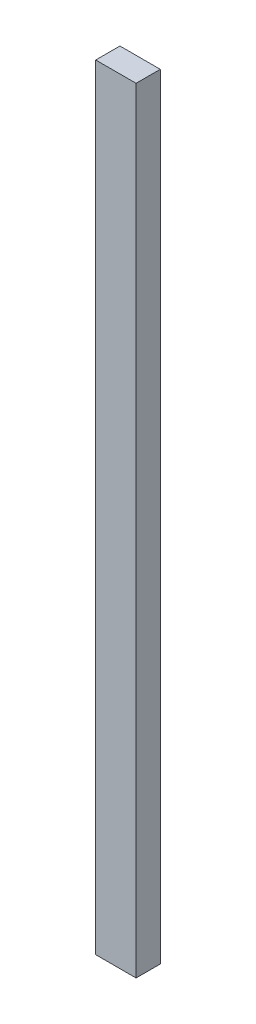
ISO-10303-21;
HEADER;
FILE_DESCRIPTION(('STEP AP214'),'2;1');
FILE_NAME('part.step','',(''),(''),'','','');
FILE_SCHEMA(('AUTOMOTIVE_DESIGN { 1 0 10303 214 1 1 1 1 }'));
ENDSEC;
DATA;
#1=APPLICATION_CONTEXT('core data for automotive mechanical design processes');
#2=APPLICATION_PROTOCOL_DEFINITION('international standard','automotive_design',2000,#1);
#3=PRODUCT_CONTEXT('',#1,'mechanical');
#4=PRODUCT('Part','Part','',(#3));
#5=PRODUCT_RELATED_PRODUCT_CATEGORY('part','',(#4));
#6=PRODUCT_DEFINITION_FORMATION('','',#4);
#7=PRODUCT_DEFINITION_CONTEXT('part definition',#1,'design');
#8=PRODUCT_DEFINITION('design','',#6,#7);
#9=PRODUCT_DEFINITION_SHAPE('','',#8);
#10=(LENGTH_UNIT() NAMED_UNIT(*) SI_UNIT(.MILLI.,.METRE.));
#11=(NAMED_UNIT(*) PLANE_ANGLE_UNIT() SI_UNIT($,.RADIAN.));
#12=(NAMED_UNIT(*) SI_UNIT($,.STERADIAN.) SOLID_ANGLE_UNIT());
#13=UNCERTAINTY_MEASURE_WITH_UNIT(LENGTH_MEASURE(1.E-05),#10,'distance_accuracy_value','');
#14=(GEOMETRIC_REPRESENTATION_CONTEXT(3) GLOBAL_UNCERTAINTY_ASSIGNED_CONTEXT((#13)) GLOBAL_UNIT_ASSIGNED_CONTEXT((#10,
#11,#12)) REPRESENTATION_CONTEXT('',''));
#15=CARTESIAN_POINT('',(0.,0.,0.));
#16=DIRECTION('',(0.,0.,1.));
#17=DIRECTION('',(1.,0.,0.));
#18=AXIS2_PLACEMENT_3D('',#15,#16,#17);
#19=CARTESIAN_POINT('',(0.,1219.2,0.));
#20=DIRECTION('',(1.,0.,0.));
#21=DIRECTION('',(0.,0.,-1.));
#22=AXIS2_PLACEMENT_3D('',#19,#20,#21);
#23=PLANE('',#22);
#24=DIRECTION('',(0.,0.,1.));
#25=VECTOR('',#24,1.);
#26=CARTESIAN_POINT('',(0.,0.,0.));
#27=LINE('',#26,#25);
#28=CARTESIAN_POINT('',(0.,0.,0.));
#29=VERTEX_POINT('',#28);
#30=CARTESIAN_POINT('',(0.,0.,38.1));
#31=VERTEX_POINT('',#30);
#32=EDGE_CURVE('E96',#29,#31,#27,.T.);
#33=ORIENTED_EDGE('',*,*,#32,.T.);
#34=DIRECTION('',(0.,-1.,0.));
#35=VECTOR('',#34,1.);
#36=CARTESIAN_POINT('',(0.,1219.2,38.1));
#37=LINE('',#36,#35);
#38=CARTESIAN_POINT('',(0.,1219.2,38.1));
#39=VERTEX_POINT('',#38);
#40=EDGE_CURVE('E11',#39,#31,#37,.T.);
#41=ORIENTED_EDGE('',*,*,#40,.F.);
#42=DIRECTION('',(0.,0.,1.));
#43=VECTOR('',#42,1.);
#44=CARTESIAN_POINT('',(0.,1219.2,0.));
#45=LINE('',#44,#43);
#46=CARTESIAN_POINT('',(0.,1219.2,0.));
#47=VERTEX_POINT('',#46);
#48=EDGE_CURVE('E84',#47,#39,#45,.T.);
#49=ORIENTED_EDGE('',*,*,#48,.F.);
#50=DIRECTION('',(0.,-1.,0.));
#51=VECTOR('',#50,1.);
#52=CARTESIAN_POINT('',(0.,1219.2,0.));
#53=LINE('',#52,#51);
#54=EDGE_CURVE('E92',#47,#29,#53,.T.);
#55=ORIENTED_EDGE('',*,*,#54,.T.);
#56=EDGE_LOOP('',(#33,#41,#49,#55));
#57=FACE_BOUND('',#56,.T.);
#58=ADVANCED_FACE('F33',(#57),#23,.F.);
#59=CARTESIAN_POINT('',(0.,1219.2,38.1));
#60=DIRECTION('',(0.,0.,-1.));
#61=DIRECTION('',(-1.,0.,0.));
#62=AXIS2_PLACEMENT_3D('',#59,#60,#61);
#63=PLANE('',#62);
#64=DIRECTION('',(1.,0.,0.));
#65=VECTOR('',#64,1.);
#66=CARTESIAN_POINT('',(0.,0.,38.1));
#67=LINE('',#66,#65);
#68=CARTESIAN_POINT('',(63.5,0.,38.1));
#69=VERTEX_POINT('',#68);
#70=EDGE_CURVE('E88',#31,#69,#67,.T.);
#71=ORIENTED_EDGE('',*,*,#70,.T.);
#72=DIRECTION('',(0.,-1.,0.));
#73=VECTOR('',#72,1.);
#74=CARTESIAN_POINT('',(63.5,1219.2,38.1));
#75=LINE('',#74,#73);
#76=CARTESIAN_POINT('',(63.5,1219.2,38.1));
#77=VERTEX_POINT('',#76);
#78=EDGE_CURVE('E41',#77,#69,#75,.T.);
#79=ORIENTED_EDGE('',*,*,#78,.F.);
#80=DIRECTION('',(1.,0.,0.));
#81=VECTOR('',#80,1.);
#82=CARTESIAN_POINT('',(0.,1219.2,38.1));
#83=LINE('',#82,#81);
#84=EDGE_CURVE('E79',#39,#77,#83,.T.);
#85=ORIENTED_EDGE('',*,*,#84,.F.);
#86=ORIENTED_EDGE('',*,*,#40,.T.);
#87=EDGE_LOOP('',(#71,#79,#85,#86));
#88=FACE_BOUND('',#87,.T.);
#89=ADVANCED_FACE('F87',(#88),#63,.F.);
#90=CARTESIAN_POINT('',(63.5,1219.2,0.));
#91=DIRECTION('',(-1.,0.,0.));
#92=DIRECTION('',(0.,0.,1.));
#93=AXIS2_PLACEMENT_3D('',#90,#91,#92);
#94=PLANE('',#93);
#95=DIRECTION('',(0.,0.,-1.));
#96=VECTOR('',#95,1.);
#97=CARTESIAN_POINT('',(63.5,0.,0.));
#98=LINE('',#97,#96);
#99=CARTESIAN_POINT('',(63.5,0.,0.));
#100=VERTEX_POINT('',#99);
#101=EDGE_CURVE('E66',#69,#100,#98,.T.);
#102=ORIENTED_EDGE('',*,*,#101,.T.);
#103=DIRECTION('',(0.,-1.,0.));
#104=VECTOR('',#103,1.);
#105=CARTESIAN_POINT('',(63.5,1219.2,0.));
#106=LINE('',#105,#104);
#107=CARTESIAN_POINT('',(63.5,1219.2,0.));
#108=VERTEX_POINT('',#107);
#109=EDGE_CURVE('E89',#108,#100,#106,.T.);
#110=ORIENTED_EDGE('',*,*,#109,.F.);
#111=DIRECTION('',(0.,0.,-1.));
#112=VECTOR('',#111,1.);
#113=CARTESIAN_POINT('',(63.5,1219.2,0.));
#114=LINE('',#113,#112);
#115=EDGE_CURVE('E82',#77,#108,#114,.T.);
#116=ORIENTED_EDGE('',*,*,#115,.F.);
#117=ORIENTED_EDGE('',*,*,#78,.T.);
#118=EDGE_LOOP('',(#102,#110,#116,#117));
#119=FACE_BOUND('',#118,.T.);
#120=ADVANCED_FACE('F90',(#119),#94,.F.);
#121=CARTESIAN_POINT('',(0.,1219.2,0.));
#122=DIRECTION('',(0.,0.,1.));
#123=DIRECTION('',(1.,0.,0.));
#124=AXIS2_PLACEMENT_3D('',#121,#122,#123);
#125=PLANE('',#124);
#126=DIRECTION('',(-1.,0.,0.));
#127=VECTOR('',#126,1.);
#128=CARTESIAN_POINT('',(0.,0.,0.));
#129=LINE('',#128,#127);
#130=EDGE_CURVE('E72',#100,#29,#129,.T.);
#131=ORIENTED_EDGE('',*,*,#130,.T.);
#132=ORIENTED_EDGE('',*,*,#54,.F.);
#133=DIRECTION('',(-1.,0.,0.));
#134=VECTOR('',#133,1.);
#135=CARTESIAN_POINT('',(0.,1219.2,0.));
#136=LINE('',#135,#134);
#137=EDGE_CURVE('E49',#108,#47,#136,.T.);
#138=ORIENTED_EDGE('',*,*,#137,.F.);
#139=ORIENTED_EDGE('',*,*,#109,.T.);
#140=EDGE_LOOP('',(#131,#132,#138,#139));
#141=FACE_BOUND('',#140,.T.);
#142=ADVANCED_FACE('F103',(#141),#125,.F.);
#143=CARTESIAN_POINT('',(0.,1219.2,0.));
#144=DIRECTION('',(0.,1.,0.));
#145=DIRECTION('',(0.,0.,1.));
#146=AXIS2_PLACEMENT_3D('',#143,#144,#145);
#147=PLANE('',#146);
#148=ORIENTED_EDGE('',*,*,#48,.T.);
#149=ORIENTED_EDGE('',*,*,#84,.T.);
#150=ORIENTED_EDGE('',*,*,#115,.T.);
#151=ORIENTED_EDGE('',*,*,#137,.T.);
#152=EDGE_LOOP('',(#148,#149,#150,#151));
#153=FACE_BOUND('',#152,.T.);
#154=ADVANCED_FACE('F80',(#153),#147,.T.);
#155=CARTESIAN_POINT('',(0.,0.,0.));
#156=DIRECTION('',(0.,1.,0.));
#157=DIRECTION('',(0.,0.,1.));
#158=AXIS2_PLACEMENT_3D('',#155,#156,#157);
#159=PLANE('',#158);
#160=ORIENTED_EDGE('',*,*,#32,.F.);
#161=ORIENTED_EDGE('',*,*,#130,.F.);
#162=ORIENTED_EDGE('',*,*,#101,.F.);
#163=ORIENTED_EDGE('',*,*,#70,.F.);
#164=EDGE_LOOP('',(#160,#161,#162,#163));
#165=FACE_BOUND('',#164,.T.);
#166=ADVANCED_FACE('F106',(#165),#159,.F.);
#167=CLOSED_SHELL('',(#58,#89,#120,#142,#154,#166));
#168=MANIFOLD_SOLID_BREP('B2',#167);
#169=ADVANCED_BREP_SHAPE_REPRESENTATION('',(#18,#168),#14);
#170=SHAPE_DEFINITION_REPRESENTATION(#9,#169);
ENDSEC;
END-ISO-10303-21;
